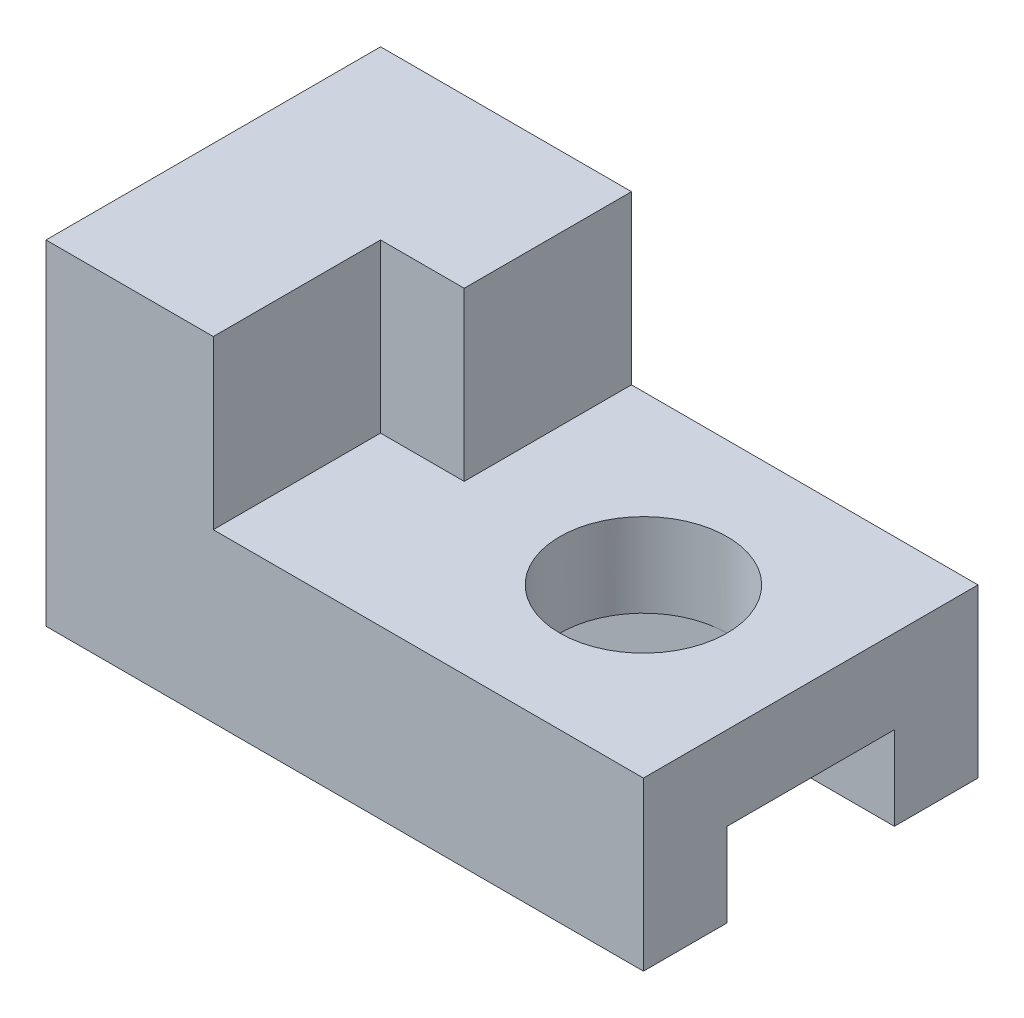
ISO-10303-21;
HEADER;
FILE_DESCRIPTION(('STEP AP214'),'2;1');
FILE_NAME('part.step','',(''),(''),'','','');
FILE_SCHEMA(('AUTOMOTIVE_DESIGN { 1 0 10303 214 1 1 1 1 }'));
ENDSEC;
DATA;
#1=APPLICATION_CONTEXT('core data for automotive mechanical design processes');
#2=APPLICATION_PROTOCOL_DEFINITION('international standard','automotive_design',2000,#1);
#3=PRODUCT_CONTEXT('',#1,'mechanical');
#4=PRODUCT('Part','Part','',(#3));
#5=PRODUCT_RELATED_PRODUCT_CATEGORY('part','',(#4));
#6=PRODUCT_DEFINITION_FORMATION('','',#4);
#7=PRODUCT_DEFINITION_CONTEXT('part definition',#1,'design');
#8=PRODUCT_DEFINITION('design','',#6,#7);
#9=PRODUCT_DEFINITION_SHAPE('','',#8);
#10=(LENGTH_UNIT() NAMED_UNIT(*) SI_UNIT(.MILLI.,.METRE.));
#11=(NAMED_UNIT(*) PLANE_ANGLE_UNIT() SI_UNIT($,.RADIAN.));
#12=(NAMED_UNIT(*) SI_UNIT($,.STERADIAN.) SOLID_ANGLE_UNIT());
#13=UNCERTAINTY_MEASURE_WITH_UNIT(LENGTH_MEASURE(1.E-05),#10,'distance_accuracy_value','');
#14=(GEOMETRIC_REPRESENTATION_CONTEXT(3) GLOBAL_UNCERTAINTY_ASSIGNED_CONTEXT((#13)) GLOBAL_UNIT_ASSIGNED_CONTEXT((#10,
#11,#12)) REPRESENTATION_CONTEXT('',''));
#15=CARTESIAN_POINT('',(0.,0.,0.));
#16=DIRECTION('',(0.,0.,1.));
#17=DIRECTION('',(1.,0.,0.));
#18=AXIS2_PLACEMENT_3D('',#15,#16,#17);
#19=CARTESIAN_POINT('',(25.,7.,-21.));
#20=DIRECTION('',(0.,1.,0.));
#21=DIRECTION('',(0.,0.,1.));
#22=AXIS2_PLACEMENT_3D('',#19,#20,#21);
#23=PLANE('',#22);
#24=DIRECTION('',(-1.,0.,0.));
#25=VECTOR('',#24,1.);
#26=CARTESIAN_POINT('',(25.,7.,-7.));
#27=LINE('',#26,#25);
#28=CARTESIAN_POINT('',(25.,7.,-7.));
#29=VERTEX_POINT('',#28);
#30=CARTESIAN_POINT('',(11.,7.,-7.));
#31=VERTEX_POINT('',#30);
#32=EDGE_CURVE('E51',#29,#31,#27,.T.);
#33=ORIENTED_EDGE('',*,*,#32,.T.);
#34=CARTESIAN_POINT('',(11.,7.,-14.));
#35=DIRECTION('',(0.,1.,0.));
#36=DIRECTION('',(0.,0.,1.));
#37=AXIS2_PLACEMENT_3D('',#34,#35,#36);
#38=CIRCLE('',#37,7.);
#39=CARTESIAN_POINT('',(11.,7.,-21.));
#40=VERTEX_POINT('',#39);
#41=EDGE_CURVE('E65',#40,#31,#38,.F.);
#42=ORIENTED_EDGE('',*,*,#41,.F.);
#43=DIRECTION('',(-1.,0.,0.));
#44=VECTOR('',#43,1.);
#45=CARTESIAN_POINT('',(25.,7.,-21.));
#46=LINE('',#45,#44);
#47=CARTESIAN_POINT('',(25.,7.,-21.));
#48=VERTEX_POINT('',#47);
#49=EDGE_CURVE('E234',#48,#40,#46,.T.);
#50=ORIENTED_EDGE('',*,*,#49,.F.);
#51=DIRECTION('',(0.,0.,-1.));
#52=VECTOR('',#51,1.);
#53=CARTESIAN_POINT('',(25.,7.,-21.));
#54=LINE('',#53,#52);
#55=EDGE_CURVE('E191',#29,#48,#54,.T.);
#56=ORIENTED_EDGE('',*,*,#55,.F.);
#57=EDGE_LOOP('',(#33,#42,#50,#56));
#58=FACE_BOUND('',#57,.T.);
#59=ADVANCED_FACE('F43',(#58),#23,.F.);
#60=CARTESIAN_POINT('',(25.,0.,-7.));
#61=DIRECTION('',(0.,1.,0.));
#62=DIRECTION('',(0.,0.,1.));
#63=AXIS2_PLACEMENT_3D('',#60,#61,#62);
#64=PLANE('',#63);
#65=DIRECTION('',(0.,0.,-1.));
#66=VECTOR('',#65,1.);
#67=CARTESIAN_POINT('',(-25.,0.,-7.));
#68=LINE('',#67,#66);
#69=CARTESIAN_POINT('',(-25.,0.,0.));
#70=VERTEX_POINT('',#69);
#71=CARTESIAN_POINT('',(-25.,0.,-7.));
#72=VERTEX_POINT('',#71);
#73=EDGE_CURVE('E184',#70,#72,#68,.T.);
#74=ORIENTED_EDGE('',*,*,#73,.T.);
#75=DIRECTION('',(-1.,0.,0.));
#76=VECTOR('',#75,1.);
#77=CARTESIAN_POINT('',(25.,0.,-7.));
#78=LINE('',#77,#76);
#79=CARTESIAN_POINT('',(25.,0.,-7.));
#80=VERTEX_POINT('',#79);
#81=EDGE_CURVE('E11',#80,#72,#78,.T.);
#82=ORIENTED_EDGE('',*,*,#81,.F.);
#83=DIRECTION('',(0.,0.,-1.));
#84=VECTOR('',#83,1.);
#85=CARTESIAN_POINT('',(25.,0.,-7.));
#86=LINE('',#85,#84);
#87=CARTESIAN_POINT('',(25.,0.,0.));
#88=VERTEX_POINT('',#87);
#89=EDGE_CURVE('E185',#88,#80,#86,.T.);
#90=ORIENTED_EDGE('',*,*,#89,.F.);
#91=DIRECTION('',(-1.,0.,0.));
#92=VECTOR('',#91,1.);
#93=CARTESIAN_POINT('',(25.,0.,0.));
#94=LINE('',#93,#92);
#95=EDGE_CURVE('E203',#88,#70,#94,.T.);
#96=ORIENTED_EDGE('',*,*,#95,.T.);
#97=EDGE_LOOP('',(#74,#82,#90,#96));
#98=FACE_BOUND('',#97,.T.);
#99=ADVANCED_FACE('F45',(#98),#64,.F.);
#100=CARTESIAN_POINT('',(25.,7.,-7.));
#101=DIRECTION('',(0.,0.,1.));
#102=DIRECTION('',(0.,-1.,0.));
#103=AXIS2_PLACEMENT_3D('',#100,#101,#102);
#104=PLANE('',#103);
#105=DIRECTION('',(0.,1.,0.));
#106=VECTOR('',#105,1.);
#107=CARTESIAN_POINT('',(-25.,7.,-7.));
#108=LINE('',#107,#106);
#109=CARTESIAN_POINT('',(-25.,7.,-7.));
#110=VERTEX_POINT('',#109);
#111=EDGE_CURVE('E206',#72,#110,#108,.T.);
#112=ORIENTED_EDGE('',*,*,#111,.T.);
#113=EDGE_CURVE('E236',#31,#110,#27,.T.);
#114=ORIENTED_EDGE('',*,*,#113,.F.);
#115=ORIENTED_EDGE('',*,*,#32,.F.);
#116=DIRECTION('',(0.,1.,0.));
#117=VECTOR('',#116,1.);
#118=CARTESIAN_POINT('',(25.,7.,-7.));
#119=LINE('',#118,#117);
#120=EDGE_CURVE('E188',#80,#29,#119,.T.);
#121=ORIENTED_EDGE('',*,*,#120,.F.);
#122=ORIENTED_EDGE('',*,*,#81,.T.);
#123=EDGE_LOOP('',(#112,#114,#115,#121,#122));
#124=FACE_BOUND('',#123,.T.);
#125=ADVANCED_FACE('F248',(#124),#104,.F.);
#126=CARTESIAN_POINT('',(-25.,7.,-21.));
#127=VERTEX_POINT('',#126);
#128=EDGE_CURVE('E233',#40,#127,#46,.T.);
#129=ORIENTED_EDGE('',*,*,#128,.F.);
#130=EDGE_CURVE('E182',#31,#40,#38,.F.);
#131=ORIENTED_EDGE('',*,*,#130,.F.);
#132=ORIENTED_EDGE('',*,*,#113,.T.);
#133=DIRECTION('',(0.,0.,-1.));
#134=VECTOR('',#133,1.);
#135=CARTESIAN_POINT('',(-25.,7.,-21.));
#136=LINE('',#135,#134);
#137=EDGE_CURVE('E209',#110,#127,#136,.T.);
#138=ORIENTED_EDGE('',*,*,#137,.T.);
#139=EDGE_LOOP('',(#129,#131,#132,#138));
#140=FACE_BOUND('',#139,.T.);
#141=ADVANCED_FACE('F244',(#140),#23,.F.);
#142=CARTESIAN_POINT('',(25.,0.,-21.));
#143=DIRECTION('',(0.,0.,-1.));
#144=DIRECTION('',(-1.,0.,0.));
#145=AXIS2_PLACEMENT_3D('',#142,#143,#144);
#146=PLANE('',#145);
#147=DIRECTION('',(0.,-1.,0.));
#148=VECTOR('',#147,1.);
#149=CARTESIAN_POINT('',(-25.,0.,-21.));
#150=LINE('',#149,#148);
#151=CARTESIAN_POINT('',(-25.,0.,-21.));
#152=VERTEX_POINT('',#151);
#153=EDGE_CURVE('E212',#127,#152,#150,.T.);
#154=ORIENTED_EDGE('',*,*,#153,.T.);
#155=DIRECTION('',(-1.,0.,0.));
#156=VECTOR('',#155,1.);
#157=CARTESIAN_POINT('',(25.,0.,-21.));
#158=LINE('',#157,#156);
#159=CARTESIAN_POINT('',(25.,0.,-21.));
#160=VERTEX_POINT('',#159);
#161=EDGE_CURVE('E230',#160,#152,#158,.T.);
#162=ORIENTED_EDGE('',*,*,#161,.F.);
#163=DIRECTION('',(0.,-1.,0.));
#164=VECTOR('',#163,1.);
#165=CARTESIAN_POINT('',(25.,0.,-21.));
#166=LINE('',#165,#164);
#167=EDGE_CURVE('E193',#48,#160,#166,.T.);
#168=ORIENTED_EDGE('',*,*,#167,.F.);
#169=ORIENTED_EDGE('',*,*,#49,.T.);
#170=ORIENTED_EDGE('',*,*,#128,.T.);
#171=EDGE_LOOP('',(#154,#162,#168,#169,#170));
#172=FACE_BOUND('',#171,.T.);
#173=ADVANCED_FACE('F257',(#172),#146,.F.);
#174=CARTESIAN_POINT('',(25.,0.,-28.));
#175=DIRECTION('',(0.,1.,0.));
#176=DIRECTION('',(0.,0.,1.));
#177=AXIS2_PLACEMENT_3D('',#174,#175,#176);
#178=PLANE('',#177);
#179=DIRECTION('',(0.,0.,-1.));
#180=VECTOR('',#179,1.);
#181=CARTESIAN_POINT('',(-25.,0.,-28.));
#182=LINE('',#181,#180);
#183=CARTESIAN_POINT('',(-25.,0.,-28.));
#184=VERTEX_POINT('',#183);
#185=EDGE_CURVE('E214',#152,#184,#182,.T.);
#186=ORIENTED_EDGE('',*,*,#185,.T.);
#187=DIRECTION('',(-1.,0.,0.));
#188=VECTOR('',#187,1.);
#189=CARTESIAN_POINT('',(25.,0.,-28.));
#190=LINE('',#189,#188);
#191=CARTESIAN_POINT('',(25.,0.,-28.));
#192=VERTEX_POINT('',#191);
#193=EDGE_CURVE('E227',#192,#184,#190,.T.);
#194=ORIENTED_EDGE('',*,*,#193,.F.);
#195=DIRECTION('',(0.,0.,-1.));
#196=VECTOR('',#195,1.);
#197=CARTESIAN_POINT('',(25.,0.,-28.));
#198=LINE('',#197,#196);
#199=EDGE_CURVE('E195',#160,#192,#198,.T.);
#200=ORIENTED_EDGE('',*,*,#199,.F.);
#201=ORIENTED_EDGE('',*,*,#161,.T.);
#202=EDGE_LOOP('',(#186,#194,#200,#201));
#203=FACE_BOUND('',#202,.T.);
#204=ADVANCED_FACE('F261',(#203),#178,.F.);
#205=CARTESIAN_POINT('',(25.,14.,-28.));
#206=DIRECTION('',(0.,0.,1.));
#207=DIRECTION('',(0.,-1.,0.));
#208=AXIS2_PLACEMENT_3D('',#205,#206,#207);
#209=PLANE('',#208);
#210=DIRECTION('',(0.,1.,0.));
#211=VECTOR('',#210,1.);
#212=CARTESIAN_POINT('',(-25.,14.,-28.));
#213=LINE('',#212,#211);
#214=CARTESIAN_POINT('',(-25.,28.,-28.));
#215=VERTEX_POINT('',#214);
#216=EDGE_CURVE('E216',#184,#215,#213,.T.);
#217=ORIENTED_EDGE('',*,*,#216,.T.);
#218=DIRECTION('',(-1.,0.,0.));
#219=VECTOR('',#218,1.);
#220=CARTESIAN_POINT('',(0.,28.,-28.));
#221=LINE('',#220,#219);
#222=CARTESIAN_POINT('',(-4.,28.,-28.));
#223=VERTEX_POINT('',#222);
#224=EDGE_CURVE('E162',#223,#215,#221,.T.);
#225=ORIENTED_EDGE('',*,*,#224,.F.);
#226=DIRECTION('',(0.,-1.,0.));
#227=VECTOR('',#226,1.);
#228=CARTESIAN_POINT('',(-4.,28.,-28.));
#229=LINE('',#228,#227);
#230=CARTESIAN_POINT('',(-4.,14.,-28.));
#231=VERTEX_POINT('',#230);
#232=EDGE_CURVE('E177',#223,#231,#229,.T.);
#233=ORIENTED_EDGE('',*,*,#232,.T.);
#234=DIRECTION('',(-1.,0.,0.));
#235=VECTOR('',#234,1.);
#236=CARTESIAN_POINT('',(25.,14.,-28.));
#237=LINE('',#236,#235);
#238=CARTESIAN_POINT('',(25.,14.,-28.));
#239=VERTEX_POINT('',#238);
#240=EDGE_CURVE('E224',#239,#231,#237,.T.);
#241=ORIENTED_EDGE('',*,*,#240,.F.);
#242=DIRECTION('',(0.,1.,0.));
#243=VECTOR('',#242,1.);
#244=CARTESIAN_POINT('',(25.,14.,-28.));
#245=LINE('',#244,#243);
#246=EDGE_CURVE('E197',#192,#239,#245,.T.);
#247=ORIENTED_EDGE('',*,*,#246,.F.);
#248=ORIENTED_EDGE('',*,*,#193,.T.);
#249=EDGE_LOOP('',(#217,#225,#233,#241,#247,#248));
#250=FACE_BOUND('',#249,.T.);
#251=ADVANCED_FACE('F308',(#250),#209,.F.);
#252=CARTESIAN_POINT('',(25.,14.,0.));
#253=DIRECTION('',(0.,-1.,0.));
#254=DIRECTION('',(0.,0.,-1.));
#255=AXIS2_PLACEMENT_3D('',#252,#253,#254);
#256=PLANE('',#255);
#257=CARTESIAN_POINT('',(11.,14.,-14.));
#258=DIRECTION('',(0.,1.,0.));
#259=DIRECTION('',(0.,0.,1.));
#260=AXIS2_PLACEMENT_3D('',#257,#258,#259);
#261=CIRCLE('',#260,7.);
#262=CARTESIAN_POINT('',(11.,14.,-7.));
#263=VERTEX_POINT('',#262);
#264=EDGE_CURVE('E144',#263,#263,#261,.T.);
#265=ORIENTED_EDGE('',*,*,#264,.F.);
#266=EDGE_LOOP('',(#265));
#267=FACE_BOUND('',#266,.T.);
#268=DIRECTION('',(-1.,0.,0.));
#269=VECTOR('',#268,1.);
#270=CARTESIAN_POINT('',(0.,14.,-14.));
#271=LINE('',#270,#269);
#272=CARTESIAN_POINT('',(-4.,14.,-14.));
#273=VERTEX_POINT('',#272);
#274=CARTESIAN_POINT('',(-11.,14.,-14.));
#275=VERTEX_POINT('',#274);
#276=EDGE_CURVE('E172',#273,#275,#271,.T.);
#277=ORIENTED_EDGE('',*,*,#276,.T.);
#278=DIRECTION('',(0.,0.,1.));
#279=VECTOR('',#278,1.);
#280=CARTESIAN_POINT('',(-11.,14.,0.));
#281=LINE('',#280,#279);
#282=CARTESIAN_POINT('',(-11.,14.,0.));
#283=VERTEX_POINT('',#282);
#284=EDGE_CURVE('E58',#275,#283,#281,.T.);
#285=ORIENTED_EDGE('',*,*,#284,.T.);
#286=DIRECTION('',(-1.,0.,0.));
#287=VECTOR('',#286,1.);
#288=CARTESIAN_POINT('',(25.,14.,0.));
#289=LINE('',#288,#287);
#290=CARTESIAN_POINT('',(25.,14.,0.));
#291=VERTEX_POINT('',#290);
#292=EDGE_CURVE('E221',#291,#283,#289,.T.);
#293=ORIENTED_EDGE('',*,*,#292,.F.);
#294=DIRECTION('',(0.,0.,1.));
#295=VECTOR('',#294,1.);
#296=CARTESIAN_POINT('',(25.,14.,0.));
#297=LINE('',#296,#295);
#298=EDGE_CURVE('E199',#239,#291,#297,.T.);
#299=ORIENTED_EDGE('',*,*,#298,.F.);
#300=ORIENTED_EDGE('',*,*,#240,.T.);
#301=DIRECTION('',(0.,0.,1.));
#302=VECTOR('',#301,1.);
#303=CARTESIAN_POINT('',(-4.,14.,0.));
#304=LINE('',#303,#302);
#305=EDGE_CURVE('E157',#231,#273,#304,.T.);
#306=ORIENTED_EDGE('',*,*,#305,.T.);
#307=EDGE_LOOP('',(#277,#285,#293,#299,#300,#306));
#308=FACE_BOUND('',#307,.T.);
#309=ADVANCED_FACE('F318',(#267,#308),#256,.F.);
#310=CARTESIAN_POINT('',(25.,0.,0.));
#311=DIRECTION('',(0.,0.,-1.));
#312=DIRECTION('',(-1.,0.,0.));
#313=AXIS2_PLACEMENT_3D('',#310,#311,#312);
#314=PLANE('',#313);
#315=DIRECTION('',(0.,-1.,0.));
#316=VECTOR('',#315,1.);
#317=CARTESIAN_POINT('',(-25.,0.,0.));
#318=LINE('',#317,#316);
#319=CARTESIAN_POINT('',(-25.,28.,0.));
#320=VERTEX_POINT('',#319);
#321=EDGE_CURVE('E189',#320,#70,#318,.T.);
#322=ORIENTED_EDGE('',*,*,#321,.T.);
#323=ORIENTED_EDGE('',*,*,#95,.F.);
#324=DIRECTION('',(0.,-1.,0.));
#325=VECTOR('',#324,1.);
#326=CARTESIAN_POINT('',(25.,0.,0.));
#327=LINE('',#326,#325);
#328=EDGE_CURVE('E201',#291,#88,#327,.T.);
#329=ORIENTED_EDGE('',*,*,#328,.F.);
#330=ORIENTED_EDGE('',*,*,#292,.T.);
#331=DIRECTION('',(0.,-1.,0.));
#332=VECTOR('',#331,1.);
#333=CARTESIAN_POINT('',(-11.,28.,0.));
#334=LINE('',#333,#332);
#335=CARTESIAN_POINT('',(-11.,28.,0.));
#336=VERTEX_POINT('',#335);
#337=EDGE_CURVE('E170',#336,#283,#334,.T.);
#338=ORIENTED_EDGE('',*,*,#337,.F.);
#339=DIRECTION('',(1.,0.,0.));
#340=VECTOR('',#339,1.);
#341=CARTESIAN_POINT('',(0.,28.,0.));
#342=LINE('',#341,#340);
#343=EDGE_CURVE('E155',#320,#336,#342,.T.);
#344=ORIENTED_EDGE('',*,*,#343,.F.);
#345=EDGE_LOOP('',(#322,#323,#329,#330,#338,#344));
#346=FACE_BOUND('',#345,.T.);
#347=ADVANCED_FACE('F331',(#346),#314,.F.);
#348=CARTESIAN_POINT('',(25.,0.,0.));
#349=DIRECTION('',(-1.,0.,0.));
#350=DIRECTION('',(0.,0.,1.));
#351=AXIS2_PLACEMENT_3D('',#348,#349,#350);
#352=PLANE('',#351);
#353=ORIENTED_EDGE('',*,*,#89,.T.);
#354=ORIENTED_EDGE('',*,*,#120,.T.);
#355=ORIENTED_EDGE('',*,*,#55,.T.);
#356=ORIENTED_EDGE('',*,*,#167,.T.);
#357=ORIENTED_EDGE('',*,*,#199,.T.);
#358=ORIENTED_EDGE('',*,*,#246,.T.);
#359=ORIENTED_EDGE('',*,*,#298,.T.);
#360=ORIENTED_EDGE('',*,*,#328,.T.);
#361=EDGE_LOOP('',(#353,#354,#355,#356,#357,#358,#359,#360));
#362=FACE_BOUND('',#361,.T.);
#363=ADVANCED_FACE('F265',(#362),#352,.F.);
#364=CARTESIAN_POINT('',(-25.,0.,0.));
#365=DIRECTION('',(-1.,0.,0.));
#366=DIRECTION('',(0.,0.,1.));
#367=AXIS2_PLACEMENT_3D('',#364,#365,#366);
#368=PLANE('',#367);
#369=ORIENTED_EDGE('',*,*,#73,.F.);
#370=ORIENTED_EDGE('',*,*,#321,.F.);
#371=DIRECTION('',(0.,0.,1.));
#372=VECTOR('',#371,1.);
#373=CARTESIAN_POINT('',(-25.,28.,0.));
#374=LINE('',#373,#372);
#375=EDGE_CURVE('E167',#215,#320,#374,.T.);
#376=ORIENTED_EDGE('',*,*,#375,.F.);
#377=ORIENTED_EDGE('',*,*,#216,.F.);
#378=ORIENTED_EDGE('',*,*,#185,.F.);
#379=ORIENTED_EDGE('',*,*,#153,.F.);
#380=ORIENTED_EDGE('',*,*,#137,.F.);
#381=ORIENTED_EDGE('',*,*,#111,.F.);
#382=EDGE_LOOP('',(#369,#370,#376,#377,#378,#379,#380,#381));
#383=FACE_BOUND('',#382,.T.);
#384=ADVANCED_FACE('F252',(#383),#368,.T.);
#385=CARTESIAN_POINT('',(11.,-0.001000000000001,-14.));
#386=DIRECTION('',(0.,1.,0.));
#387=DIRECTION('',(0.,0.,1.));
#388=AXIS2_PLACEMENT_3D('',#385,#386,#387);
#389=CYLINDRICAL_SURFACE('',#388,7.);
#390=ORIENTED_EDGE('',*,*,#264,.T.);
#391=EDGE_LOOP('',(#390));
#392=FACE_BOUND('',#391,.T.);
#393=ORIENTED_EDGE('',*,*,#130,.T.);
#394=ORIENTED_EDGE('',*,*,#41,.T.);
#395=EDGE_LOOP('',(#393,#394));
#396=FACE_BOUND('',#395,.T.);
#397=ADVANCED_FACE('F361',(#392,#396),#389,.F.);
#398=CARTESIAN_POINT('',(-11.,28.,0.));
#399=DIRECTION('',(1.,0.,0.));
#400=DIRECTION('',(0.,0.,-1.));
#401=AXIS2_PLACEMENT_3D('',#398,#399,#400);
#402=PLANE('',#401);
#403=ORIENTED_EDGE('',*,*,#284,.F.);
#404=DIRECTION('',(0.,-1.,0.));
#405=VECTOR('',#404,1.);
#406=CARTESIAN_POINT('',(-11.,28.,-14.));
#407=LINE('',#406,#405);
#408=CARTESIAN_POINT('',(-11.,28.,-14.));
#409=VERTEX_POINT('',#408);
#410=EDGE_CURVE('E136',#409,#275,#407,.T.);
#411=ORIENTED_EDGE('',*,*,#410,.F.);
#412=DIRECTION('',(0.,0.,1.));
#413=VECTOR('',#412,1.);
#414=CARTESIAN_POINT('',(-11.,28.,0.));
#415=LINE('',#414,#413);
#416=EDGE_CURVE('E139',#409,#336,#415,.T.);
#417=ORIENTED_EDGE('',*,*,#416,.T.);
#418=ORIENTED_EDGE('',*,*,#337,.T.);
#419=EDGE_LOOP('',(#403,#411,#417,#418));
#420=FACE_BOUND('',#419,.T.);
#421=ADVANCED_FACE('F138',(#420),#402,.T.);
#422=CARTESIAN_POINT('',(0.,28.,-14.));
#423=DIRECTION('',(0.,0.,1.));
#424=DIRECTION('',(0.,-1.,0.));
#425=AXIS2_PLACEMENT_3D('',#422,#423,#424);
#426=PLANE('',#425);
#427=ORIENTED_EDGE('',*,*,#276,.F.);
#428=DIRECTION('',(0.,-1.,0.));
#429=VECTOR('',#428,1.);
#430=CARTESIAN_POINT('',(-4.,28.,-14.));
#431=LINE('',#430,#429);
#432=CARTESIAN_POINT('',(-4.,28.,-14.));
#433=VERTEX_POINT('',#432);
#434=EDGE_CURVE('E145',#433,#273,#431,.T.);
#435=ORIENTED_EDGE('',*,*,#434,.F.);
#436=DIRECTION('',(-1.,0.,0.));
#437=VECTOR('',#436,1.);
#438=CARTESIAN_POINT('',(0.,28.,-14.));
#439=LINE('',#438,#437);
#440=EDGE_CURVE('E151',#433,#409,#439,.T.);
#441=ORIENTED_EDGE('',*,*,#440,.T.);
#442=ORIENTED_EDGE('',*,*,#410,.T.);
#443=EDGE_LOOP('',(#427,#435,#441,#442));
#444=FACE_BOUND('',#443,.T.);
#445=ADVANCED_FACE('F159',(#444),#426,.T.);
#446=CARTESIAN_POINT('',(-4.,28.,0.));
#447=DIRECTION('',(1.,0.,0.));
#448=DIRECTION('',(0.,0.,-1.));
#449=AXIS2_PLACEMENT_3D('',#446,#447,#448);
#450=PLANE('',#449);
#451=ORIENTED_EDGE('',*,*,#305,.F.);
#452=ORIENTED_EDGE('',*,*,#232,.F.);
#453=DIRECTION('',(0.,0.,1.));
#454=VECTOR('',#453,1.);
#455=CARTESIAN_POINT('',(-4.,28.,0.));
#456=LINE('',#455,#454);
#457=EDGE_CURVE('E160',#223,#433,#456,.T.);
#458=ORIENTED_EDGE('',*,*,#457,.T.);
#459=ORIENTED_EDGE('',*,*,#434,.T.);
#460=EDGE_LOOP('',(#451,#452,#458,#459));
#461=FACE_BOUND('',#460,.T.);
#462=ADVANCED_FACE('F392',(#461),#450,.T.);
#463=CARTESIAN_POINT('',(0.,28.,0.));
#464=DIRECTION('',(0.,1.,0.));
#465=DIRECTION('',(0.,0.,1.));
#466=AXIS2_PLACEMENT_3D('',#463,#464,#465);
#467=PLANE('',#466);
#468=ORIENTED_EDGE('',*,*,#416,.F.);
#469=ORIENTED_EDGE('',*,*,#440,.F.);
#470=ORIENTED_EDGE('',*,*,#457,.F.);
#471=ORIENTED_EDGE('',*,*,#224,.T.);
#472=ORIENTED_EDGE('',*,*,#375,.T.);
#473=ORIENTED_EDGE('',*,*,#343,.T.);
#474=EDGE_LOOP('',(#468,#469,#470,#471,#472,#473));
#475=FACE_BOUND('',#474,.T.);
#476=ADVANCED_FACE('F149',(#475),#467,.T.);
#477=CLOSED_SHELL('',(#59,#99,#125,#141,#173,#204,#251,#309,#347,#363,#384,#397,#421,#445,#462,#476));
#478=MANIFOLD_SOLID_BREP('B2',#477);
#479=ADVANCED_BREP_SHAPE_REPRESENTATION('',(#18,#478),#14);
#480=SHAPE_DEFINITION_REPRESENTATION(#9,#479);
ENDSEC;
END-ISO-10303-21;
